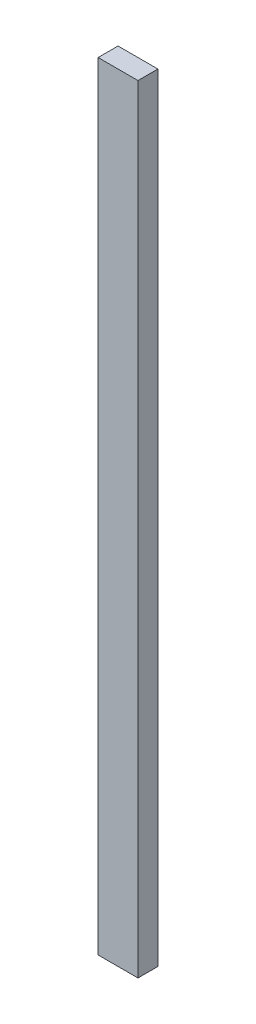
ISO-10303-21;
HEADER;
FILE_DESCRIPTION(('STEP AP214'),'2;1');
FILE_NAME('part.step','',(''),(''),'','','');
FILE_SCHEMA(('AUTOMOTIVE_DESIGN { 1 0 10303 214 1 1 1 1 }'));
ENDSEC;
DATA;
#1=APPLICATION_CONTEXT('core data for automotive mechanical design processes');
#2=APPLICATION_PROTOCOL_DEFINITION('international standard','automotive_design',2000,#1);
#3=PRODUCT_CONTEXT('',#1,'mechanical');
#4=PRODUCT('Part','Part','',(#3));
#5=PRODUCT_RELATED_PRODUCT_CATEGORY('part','',(#4));
#6=PRODUCT_DEFINITION_FORMATION('','',#4);
#7=PRODUCT_DEFINITION_CONTEXT('part definition',#1,'design');
#8=PRODUCT_DEFINITION('design','',#6,#7);
#9=PRODUCT_DEFINITION_SHAPE('','',#8);
#10=(LENGTH_UNIT() NAMED_UNIT(*) SI_UNIT(.MILLI.,.METRE.));
#11=(NAMED_UNIT(*) PLANE_ANGLE_UNIT() SI_UNIT($,.RADIAN.));
#12=(NAMED_UNIT(*) SI_UNIT($,.STERADIAN.) SOLID_ANGLE_UNIT());
#13=UNCERTAINTY_MEASURE_WITH_UNIT(LENGTH_MEASURE(1.E-05),#10,'distance_accuracy_value','');
#14=(GEOMETRIC_REPRESENTATION_CONTEXT(3) GLOBAL_UNCERTAINTY_ASSIGNED_CONTEXT((#13)) GLOBAL_UNIT_ASSIGNED_CONTEXT((#10,
#11,#12)) REPRESENTATION_CONTEXT('',''));
#15=CARTESIAN_POINT('',(0.,0.,0.));
#16=DIRECTION('',(0.,0.,1.));
#17=DIRECTION('',(1.,0.,0.));
#18=AXIS2_PLACEMENT_3D('',#15,#16,#17);
#19=CARTESIAN_POINT('',(0.,780.,0.));
#20=DIRECTION('',(1.,0.,0.));
#21=DIRECTION('',(0.,0.,-1.));
#22=AXIS2_PLACEMENT_3D('',#19,#20,#21);
#23=PLANE('',#22);
#24=DIRECTION('',(0.,0.,1.));
#25=VECTOR('',#24,1.);
#26=CARTESIAN_POINT('',(0.,0.,0.));
#27=LINE('',#26,#25);
#28=CARTESIAN_POINT('',(0.,0.,-20.));
#29=VERTEX_POINT('',#28);
#30=CARTESIAN_POINT('',(0.,0.,0.));
#31=VERTEX_POINT('',#30);
#32=EDGE_CURVE('E97',#29,#31,#27,.T.);
#33=ORIENTED_EDGE('',*,*,#32,.T.);
#34=DIRECTION('',(0.,-1.,0.));
#35=VECTOR('',#34,1.);
#36=CARTESIAN_POINT('',(0.,780.,0.));
#37=LINE('',#36,#35);
#38=CARTESIAN_POINT('',(0.,780.,0.));
#39=VERTEX_POINT('',#38);
#40=EDGE_CURVE('E11',#39,#31,#37,.T.);
#41=ORIENTED_EDGE('',*,*,#40,.F.);
#42=DIRECTION('',(0.,0.,1.));
#43=VECTOR('',#42,1.);
#44=CARTESIAN_POINT('',(0.,780.,0.));
#45=LINE('',#44,#43);
#46=CARTESIAN_POINT('',(0.,780.,-20.));
#47=VERTEX_POINT('',#46);
#48=EDGE_CURVE('E85',#47,#39,#45,.T.);
#49=ORIENTED_EDGE('',*,*,#48,.F.);
#50=DIRECTION('',(0.,-1.,0.));
#51=VECTOR('',#50,1.);
#52=CARTESIAN_POINT('',(0.,780.,-20.));
#53=LINE('',#52,#51);
#54=EDGE_CURVE('E93',#47,#29,#53,.T.);
#55=ORIENTED_EDGE('',*,*,#54,.T.);
#56=EDGE_LOOP('',(#33,#41,#49,#55));
#57=FACE_BOUND('',#56,.T.);
#58=ADVANCED_FACE('F34',(#57),#23,.F.);
#59=CARTESIAN_POINT('',(0.,780.,0.));
#60=DIRECTION('',(0.,0.,-1.));
#61=DIRECTION('',(-1.,0.,0.));
#62=AXIS2_PLACEMENT_3D('',#59,#60,#61);
#63=PLANE('',#62);
#64=DIRECTION('',(1.,0.,0.));
#65=VECTOR('',#64,1.);
#66=CARTESIAN_POINT('',(0.,0.,0.));
#67=LINE('',#66,#65);
#68=CARTESIAN_POINT('',(40.,0.,0.));
#69=VERTEX_POINT('',#68);
#70=EDGE_CURVE('E89',#31,#69,#67,.T.);
#71=ORIENTED_EDGE('',*,*,#70,.T.);
#72=DIRECTION('',(0.,-1.,0.));
#73=VECTOR('',#72,1.);
#74=CARTESIAN_POINT('',(40.,780.,0.));
#75=LINE('',#74,#73);
#76=CARTESIAN_POINT('',(40.,780.,0.));
#77=VERTEX_POINT('',#76);
#78=EDGE_CURVE('E42',#77,#69,#75,.T.);
#79=ORIENTED_EDGE('',*,*,#78,.F.);
#80=DIRECTION('',(1.,0.,0.));
#81=VECTOR('',#80,1.);
#82=CARTESIAN_POINT('',(0.,780.,0.));
#83=LINE('',#82,#81);
#84=EDGE_CURVE('E80',#39,#77,#83,.T.);
#85=ORIENTED_EDGE('',*,*,#84,.F.);
#86=ORIENTED_EDGE('',*,*,#40,.T.);
#87=EDGE_LOOP('',(#71,#79,#85,#86));
#88=FACE_BOUND('',#87,.T.);
#89=ADVANCED_FACE('F88',(#88),#63,.F.);
#90=CARTESIAN_POINT('',(40.,780.,0.));
#91=DIRECTION('',(-1.,0.,0.));
#92=DIRECTION('',(0.,0.,1.));
#93=AXIS2_PLACEMENT_3D('',#90,#91,#92);
#94=PLANE('',#93);
#95=DIRECTION('',(0.,0.,-1.));
#96=VECTOR('',#95,1.);
#97=CARTESIAN_POINT('',(40.,0.,0.));
#98=LINE('',#97,#96);
#99=CARTESIAN_POINT('',(40.,0.,-20.));
#100=VERTEX_POINT('',#99);
#101=EDGE_CURVE('E67',#69,#100,#98,.T.);
#102=ORIENTED_EDGE('',*,*,#101,.T.);
#103=DIRECTION('',(0.,-1.,0.));
#104=VECTOR('',#103,1.);
#105=CARTESIAN_POINT('',(40.,780.,-20.));
#106=LINE('',#105,#104);
#107=CARTESIAN_POINT('',(40.,780.,-20.));
#108=VERTEX_POINT('',#107);
#109=EDGE_CURVE('E90',#108,#100,#106,.T.);
#110=ORIENTED_EDGE('',*,*,#109,.F.);
#111=DIRECTION('',(0.,0.,-1.));
#112=VECTOR('',#111,1.);
#113=CARTESIAN_POINT('',(40.,780.,0.));
#114=LINE('',#113,#112);
#115=EDGE_CURVE('E83',#77,#108,#114,.T.);
#116=ORIENTED_EDGE('',*,*,#115,.F.);
#117=ORIENTED_EDGE('',*,*,#78,.T.);
#118=EDGE_LOOP('',(#102,#110,#116,#117));
#119=FACE_BOUND('',#118,.T.);
#120=ADVANCED_FACE('F91',(#119),#94,.F.);
#121=CARTESIAN_POINT('',(0.,780.,-20.));
#122=DIRECTION('',(0.,0.,1.));
#123=DIRECTION('',(1.,0.,0.));
#124=AXIS2_PLACEMENT_3D('',#121,#122,#123);
#125=PLANE('',#124);
#126=DIRECTION('',(-1.,0.,0.));
#127=VECTOR('',#126,1.);
#128=CARTESIAN_POINT('',(0.,0.,-20.));
#129=LINE('',#128,#127);
#130=EDGE_CURVE('E73',#100,#29,#129,.T.);
#131=ORIENTED_EDGE('',*,*,#130,.T.);
#132=ORIENTED_EDGE('',*,*,#54,.F.);
#133=DIRECTION('',(-1.,0.,0.));
#134=VECTOR('',#133,1.);
#135=CARTESIAN_POINT('',(0.,780.,-20.));
#136=LINE('',#135,#134);
#137=EDGE_CURVE('E50',#108,#47,#136,.T.);
#138=ORIENTED_EDGE('',*,*,#137,.F.);
#139=ORIENTED_EDGE('',*,*,#109,.T.);
#140=EDGE_LOOP('',(#131,#132,#138,#139));
#141=FACE_BOUND('',#140,.T.);
#142=ADVANCED_FACE('F104',(#141),#125,.F.);
#143=CARTESIAN_POINT('',(0.,780.,0.));
#144=DIRECTION('',(0.,-1.,0.));
#145=DIRECTION('',(0.,0.,-1.));
#146=AXIS2_PLACEMENT_3D('',#143,#144,#145);
#147=PLANE('',#146);
#148=ORIENTED_EDGE('',*,*,#48,.T.);
#149=ORIENTED_EDGE('',*,*,#84,.T.);
#150=ORIENTED_EDGE('',*,*,#115,.T.);
#151=ORIENTED_EDGE('',*,*,#137,.T.);
#152=EDGE_LOOP('',(#148,#149,#150,#151));
#153=FACE_BOUND('',#152,.T.);
#154=ADVANCED_FACE('F81',(#153),#147,.F.);
#155=CARTESIAN_POINT('',(0.,0.,0.));
#156=DIRECTION('',(0.,-1.,0.));
#157=DIRECTION('',(0.,0.,-1.));
#158=AXIS2_PLACEMENT_3D('',#155,#156,#157);
#159=PLANE('',#158);
#160=ORIENTED_EDGE('',*,*,#32,.F.);
#161=ORIENTED_EDGE('',*,*,#130,.F.);
#162=ORIENTED_EDGE('',*,*,#101,.F.);
#163=ORIENTED_EDGE('',*,*,#70,.F.);
#164=EDGE_LOOP('',(#160,#161,#162,#163));
#165=FACE_BOUND('',#164,.T.);
#166=ADVANCED_FACE('F107',(#165),#159,.T.);
#167=CLOSED_SHELL('',(#58,#89,#120,#142,#154,#166));
#168=MANIFOLD_SOLID_BREP('B2',#167);
#169=ADVANCED_BREP_SHAPE_REPRESENTATION('',(#18,#168),#14);
#170=SHAPE_DEFINITION_REPRESENTATION(#9,#169);
ENDSEC;
END-ISO-10303-21;
